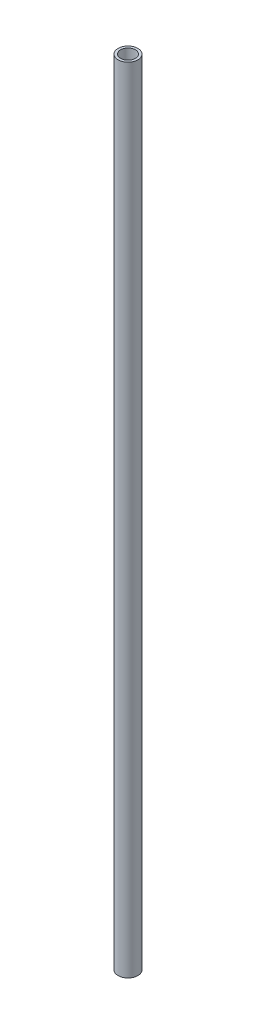
ISO-10303-21;
HEADER;
FILE_DESCRIPTION(('STEP AP214'),'2;1');
FILE_NAME('part.step','',(''),(''),'','','');
FILE_SCHEMA(('AUTOMOTIVE_DESIGN { 1 0 10303 214 1 1 1 1 }'));
ENDSEC;
DATA;
#1=APPLICATION_CONTEXT('core data for automotive mechanical design processes');
#2=APPLICATION_PROTOCOL_DEFINITION('international standard','automotive_design',2000,#1);
#3=PRODUCT_CONTEXT('',#1,'mechanical');
#4=PRODUCT('Part','Part','',(#3));
#5=PRODUCT_RELATED_PRODUCT_CATEGORY('part','',(#4));
#6=PRODUCT_DEFINITION_FORMATION('','',#4);
#7=PRODUCT_DEFINITION_CONTEXT('part definition',#1,'design');
#8=PRODUCT_DEFINITION('design','',#6,#7);
#9=PRODUCT_DEFINITION_SHAPE('','',#8);
#10=(LENGTH_UNIT() NAMED_UNIT(*) SI_UNIT(.MILLI.,.METRE.));
#11=(NAMED_UNIT(*) PLANE_ANGLE_UNIT() SI_UNIT($,.RADIAN.));
#12=(NAMED_UNIT(*) SI_UNIT($,.STERADIAN.) SOLID_ANGLE_UNIT());
#13=UNCERTAINTY_MEASURE_WITH_UNIT(LENGTH_MEASURE(1.E-05),#10,'distance_accuracy_value','');
#14=(GEOMETRIC_REPRESENTATION_CONTEXT(3) GLOBAL_UNCERTAINTY_ASSIGNED_CONTEXT((#13)) GLOBAL_UNIT_ASSIGNED_CONTEXT((#10,
#11,#12)) REPRESENTATION_CONTEXT('',''));
#15=CARTESIAN_POINT('',(0.,0.,0.));
#16=DIRECTION('',(0.,0.,1.));
#17=DIRECTION('',(1.,0.,0.));
#18=AXIS2_PLACEMENT_3D('',#15,#16,#17);
#19=CARTESIAN_POINT('',(0.,1016.,0.));
#20=DIRECTION('',(0.,-1.,0.));
#21=DIRECTION('',(0.,0.,-1.));
#22=AXIS2_PLACEMENT_3D('',#19,#20,#21);
#23=CYLINDRICAL_SURFACE('',#22,12.7);
#24=CARTESIAN_POINT('',(0.,1016.,0.));
#25=DIRECTION('',(0.,1.,0.));
#26=DIRECTION('',(0.,0.,1.));
#27=AXIS2_PLACEMENT_3D('',#24,#25,#26);
#28=CIRCLE('',#27,12.7);
#29=CARTESIAN_POINT('',(0.,1016.,12.7));
#30=VERTEX_POINT('',#29);
#31=EDGE_CURVE('E10',#30,#30,#28,.T.);
#32=ORIENTED_EDGE('',*,*,#31,.F.);
#33=EDGE_LOOP('',(#32));
#34=FACE_BOUND('',#33,.T.);
#35=CARTESIAN_POINT('',(0.,0.,0.));
#36=DIRECTION('',(0.,1.,0.));
#37=DIRECTION('',(0.,0.,1.));
#38=AXIS2_PLACEMENT_3D('',#35,#36,#37);
#39=CIRCLE('',#38,12.7);
#40=CARTESIAN_POINT('',(0.,0.,12.7));
#41=VERTEX_POINT('',#40);
#42=EDGE_CURVE('E42',#41,#41,#39,.T.);
#43=ORIENTED_EDGE('',*,*,#42,.T.);
#44=EDGE_LOOP('',(#43));
#45=FACE_BOUND('',#44,.T.);
#46=ADVANCED_FACE('F39',(#34,#45),#23,.T.);
#47=CARTESIAN_POINT('',(0.,1016.,0.));
#48=DIRECTION('',(0.,1.,0.));
#49=DIRECTION('',(0.,0.,1.));
#50=AXIS2_PLACEMENT_3D('',#47,#48,#49);
#51=PLANE('',#50);
#52=CARTESIAN_POINT('',(0.,1016.,0.));
#53=DIRECTION('',(0.,1.,0.));
#54=DIRECTION('',(0.,0.,1.));
#55=AXIS2_PLACEMENT_3D('',#52,#53,#54);
#56=CIRCLE('',#55,9.525);
#57=CARTESIAN_POINT('',(0.,1016.,9.525));
#58=VERTEX_POINT('',#57);
#59=EDGE_CURVE('E51',#58,#58,#56,.T.);
#60=ORIENTED_EDGE('',*,*,#59,.F.);
#61=EDGE_LOOP('',(#60));
#62=FACE_BOUND('',#61,.T.);
#63=ORIENTED_EDGE('',*,*,#31,.T.);
#64=EDGE_LOOP('',(#63));
#65=FACE_BOUND('',#64,.T.);
#66=ADVANCED_FACE('F64',(#62,#65),#51,.T.);
#67=CARTESIAN_POINT('',(0.,0.,0.));
#68=DIRECTION('',(0.,1.,0.));
#69=DIRECTION('',(0.,0.,1.));
#70=AXIS2_PLACEMENT_3D('',#67,#68,#69);
#71=PLANE('',#70);
#72=CARTESIAN_POINT('',(0.,0.,0.));
#73=DIRECTION('',(0.,1.,0.));
#74=DIRECTION('',(0.,0.,1.));
#75=AXIS2_PLACEMENT_3D('',#72,#73,#74);
#76=CIRCLE('',#75,9.525);
#77=CARTESIAN_POINT('',(0.,0.,9.525));
#78=VERTEX_POINT('',#77);
#79=EDGE_CURVE('E53',#78,#78,#76,.T.);
#80=ORIENTED_EDGE('',*,*,#79,.T.);
#81=EDGE_LOOP('',(#80));
#82=FACE_BOUND('',#81,.T.);
#83=ORIENTED_EDGE('',*,*,#42,.F.);
#84=EDGE_LOOP('',(#83));
#85=FACE_BOUND('',#84,.T.);
#86=ADVANCED_FACE('F66',(#82,#85),#71,.F.);
#87=CARTESIAN_POINT('',(0.,1016.,0.));
#88=DIRECTION('',(0.,-1.,0.));
#89=DIRECTION('',(0.,0.,-1.));
#90=AXIS2_PLACEMENT_3D('',#87,#88,#89);
#91=CYLINDRICAL_SURFACE('',#90,9.525);
#92=ORIENTED_EDGE('',*,*,#59,.T.);
#93=EDGE_LOOP('',(#92));
#94=FACE_BOUND('',#93,.T.);
#95=ORIENTED_EDGE('',*,*,#79,.F.);
#96=EDGE_LOOP('',(#95));
#97=FACE_BOUND('',#96,.T.);
#98=ADVANCED_FACE('F61',(#94,#97),#91,.F.);
#99=CLOSED_SHELL('',(#46,#66,#86,#98));
#100=MANIFOLD_SOLID_BREP('B2',#99);
#101=ADVANCED_BREP_SHAPE_REPRESENTATION('',(#18,#100),#14);
#102=SHAPE_DEFINITION_REPRESENTATION(#9,#101);
ENDSEC;
END-ISO-10303-21;
